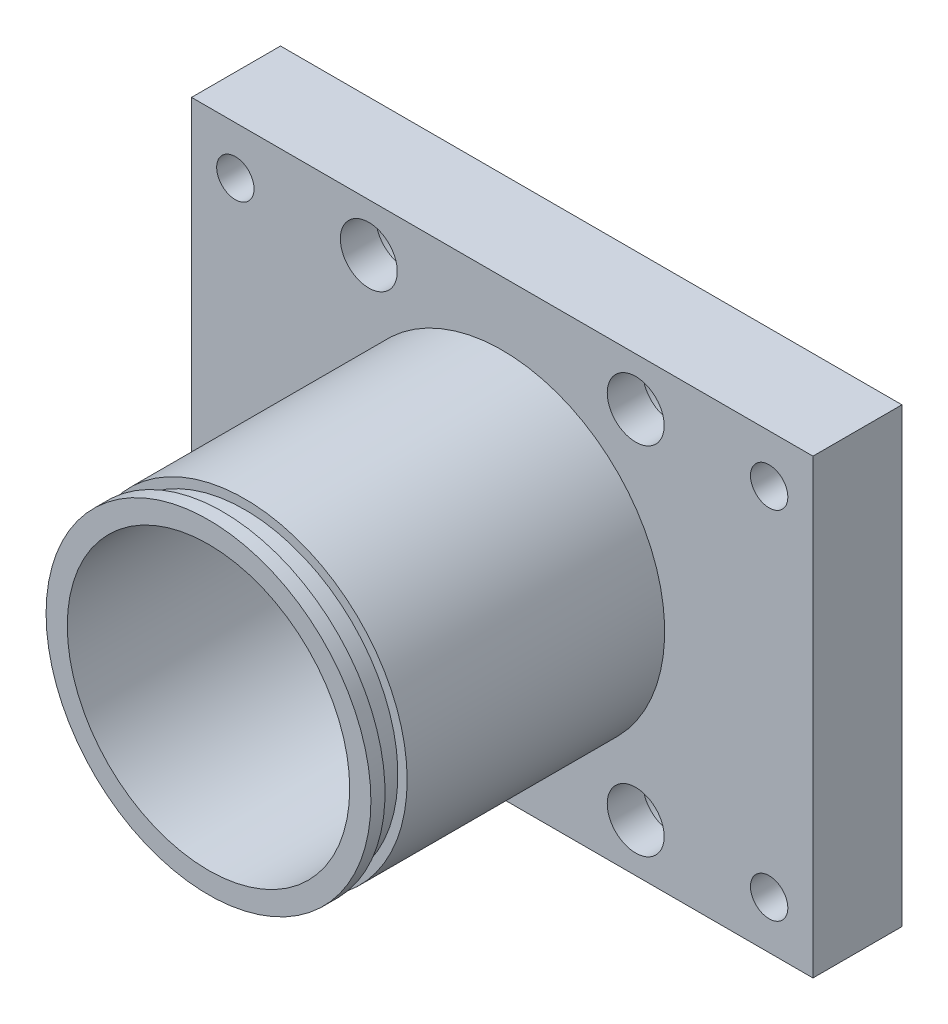
ISO-10303-21;
HEADER;
FILE_DESCRIPTION(('STEP AP214'),'2;1');
FILE_NAME('part.step','',(''),(''),'','','');
FILE_SCHEMA(('AUTOMOTIVE_DESIGN { 1 0 10303 214 1 1 1 1 }'));
ENDSEC;
DATA;
#1=APPLICATION_CONTEXT('core data for automotive mechanical design processes');
#2=APPLICATION_PROTOCOL_DEFINITION('international standard','automotive_design',2000,#1);
#3=PRODUCT_CONTEXT('',#1,'mechanical');
#4=PRODUCT('Part','Part','',(#3));
#5=PRODUCT_RELATED_PRODUCT_CATEGORY('part','',(#4));
#6=PRODUCT_DEFINITION_FORMATION('','',#4);
#7=PRODUCT_DEFINITION_CONTEXT('part definition',#1,'design');
#8=PRODUCT_DEFINITION('design','',#6,#7);
#9=PRODUCT_DEFINITION_SHAPE('','',#8);
#10=(LENGTH_UNIT() NAMED_UNIT(*) SI_UNIT(.MILLI.,.METRE.));
#11=(NAMED_UNIT(*) PLANE_ANGLE_UNIT() SI_UNIT($,.RADIAN.));
#12=(NAMED_UNIT(*) SI_UNIT($,.STERADIAN.) SOLID_ANGLE_UNIT());
#13=UNCERTAINTY_MEASURE_WITH_UNIT(LENGTH_MEASURE(1.E-05),#10,'distance_accuracy_value','');
#14=(GEOMETRIC_REPRESENTATION_CONTEXT(3) GLOBAL_UNCERTAINTY_ASSIGNED_CONTEXT((#13)) GLOBAL_UNIT_ASSIGNED_CONTEXT((#10,
#11,#12)) REPRESENTATION_CONTEXT('',''));
#15=CARTESIAN_POINT('',(0.,0.,0.));
#16=DIRECTION('',(0.,0.,1.));
#17=DIRECTION('',(1.,0.,0.));
#18=AXIS2_PLACEMENT_3D('',#15,#16,#17);
#19=CARTESIAN_POINT('',(0.,0.,43.02));
#20=DIRECTION('',(0.,0.,-1.));
#21=DIRECTION('',(-1.,0.,0.));
#22=AXIS2_PLACEMENT_3D('',#19,#20,#21);
#23=CYLINDRICAL_SURFACE('',#22,18.25625);
#24=CARTESIAN_POINT('',(0.,0.,43.02));
#25=DIRECTION('',(0.,0.,1.));
#26=DIRECTION('',(1.,0.,0.));
#27=AXIS2_PLACEMENT_3D('',#24,#25,#26);
#28=CIRCLE('',#27,18.25625);
#29=CARTESIAN_POINT('',(18.25625,0.,43.02));
#30=VERTEX_POINT('',#29);
#31=EDGE_CURVE('E140',#30,#30,#28,.T.);
#32=ORIENTED_EDGE('',*,*,#31,.F.);
#33=EDGE_LOOP('',(#32));
#34=FACE_BOUND('',#33,.T.);
#35=CARTESIAN_POINT('',(0.,0.,41.4325));
#36=DIRECTION('',(0.,0.,-1.));
#37=DIRECTION('',(-1.,0.,0.));
#38=AXIS2_PLACEMENT_3D('',#35,#36,#37);
#39=CIRCLE('',#38,18.25625);
#40=CARTESIAN_POINT('',(-18.25625,0.,41.4325));
#41=VERTEX_POINT('',#40);
#42=EDGE_CURVE('E36',#41,#41,#39,.T.);
#43=ORIENTED_EDGE('',*,*,#42,.F.);
#44=EDGE_LOOP('',(#43));
#45=FACE_BOUND('',#44,.T.);
#46=ADVANCED_FACE('F32',(#34,#45),#23,.T.);
#47=CARTESIAN_POINT('',(0.,0.,10.));
#48=DIRECTION('',(0.,0.,-1.));
#49=DIRECTION('',(-1.,0.,0.));
#50=AXIS2_PLACEMENT_3D('',#47,#48,#49);
#51=CIRCLE('',#50,18.25625);
#52=CARTESIAN_POINT('',(-18.25625,0.,10.));
#53=VERTEX_POINT('',#52);
#54=EDGE_CURVE('E11',#53,#53,#51,.F.);
#55=ORIENTED_EDGE('',*,*,#54,.T.);
#56=EDGE_LOOP('',(#55));
#57=FACE_BOUND('',#56,.T.);
#58=CARTESIAN_POINT('',(0.,0.,38.9433));
#59=DIRECTION('',(0.,0.,1.));
#60=DIRECTION('',(1.,0.,0.));
#61=AXIS2_PLACEMENT_3D('',#58,#59,#60);
#62=CIRCLE('',#61,18.25625);
#63=CARTESIAN_POINT('',(18.25625,0.,38.9433));
#64=VERTEX_POINT('',#63);
#65=EDGE_CURVE('E111',#64,#64,#62,.T.);
#66=ORIENTED_EDGE('',*,*,#65,.F.);
#67=EDGE_LOOP('',(#66));
#68=FACE_BOUND('',#67,.T.);
#69=ADVANCED_FACE('F247',(#57,#68),#23,.T.);
#70=CARTESIAN_POINT('',(34.925,25.4,0.));
#71=DIRECTION('',(0.,0.,-1.));
#72=DIRECTION('',(-1.,0.,0.));
#73=AXIS2_PLACEMENT_3D('',#70,#71,#72);
#74=PLANE('',#73);
#75=CARTESIAN_POINT('',(0.,0.,0.));
#76=DIRECTION('',(0.,0.,1.));
#77=DIRECTION('',(1.,0.,0.));
#78=AXIS2_PLACEMENT_3D('',#75,#76,#77);
#79=CIRCLE('',#78,15.875);
#80=CARTESIAN_POINT('',(15.875,0.,0.));
#81=VERTEX_POINT('',#80);
#82=EDGE_CURVE('E105',#81,#81,#79,.T.);
#83=ORIENTED_EDGE('',*,*,#82,.T.);
#84=EDGE_LOOP('',(#83));
#85=FACE_BOUND('',#84,.T.);
#86=CARTESIAN_POINT('',(0.,0.,0.));
#87=DIRECTION('',(0.,0.,-1.));
#88=DIRECTION('',(-1.,0.,0.));
#89=AXIS2_PLACEMENT_3D('',#86,#87,#88);
#90=CIRCLE('',#89,16.66875);
#91=CARTESIAN_POINT('',(-16.66875,0.,0.));
#92=VERTEX_POINT('',#91);
#93=EDGE_CURVE('E117',#92,#92,#90,.T.);
#94=ORIENTED_EDGE('',*,*,#93,.T.);
#95=EDGE_LOOP('',(#94));
#96=FACE_BOUND('',#95,.T.);
#97=ADVANCED_FACE('F218',(#85,#96),#74,.T.);
#98=CARTESIAN_POINT('',(34.925,25.4,10.));
#99=DIRECTION('',(0.,0.,-1.));
#100=DIRECTION('',(-1.,0.,0.));
#101=AXIS2_PLACEMENT_3D('',#98,#99,#100);
#102=PLANE('',#101);
#103=DIRECTION('',(0.,1.,0.));
#104=VECTOR('',#103,1.);
#105=CARTESIAN_POINT('',(34.925,-25.4,10.));
#106=LINE('',#105,#104);
#107=CARTESIAN_POINT('',(34.925,-25.4,10.));
#108=VERTEX_POINT('',#107);
#109=CARTESIAN_POINT('',(34.925,25.4,10.));
#110=VERTEX_POINT('',#109);
#111=EDGE_CURVE('E88',#108,#110,#106,.T.);
#112=ORIENTED_EDGE('',*,*,#111,.T.);
#113=DIRECTION('',(-1.,0.,0.));
#114=VECTOR('',#113,1.);
#115=CARTESIAN_POINT('',(-34.925,25.4,10.));
#116=LINE('',#115,#114);
#117=CARTESIAN_POINT('',(-34.925,25.4,10.));
#118=VERTEX_POINT('',#117);
#119=EDGE_CURVE('E82',#110,#118,#116,.T.);
#120=ORIENTED_EDGE('',*,*,#119,.T.);
#121=DIRECTION('',(0.,-1.,0.));
#122=VECTOR('',#121,1.);
#123=CARTESIAN_POINT('',(-34.925,-25.4,10.));
#124=LINE('',#123,#122);
#125=CARTESIAN_POINT('',(-34.925,-25.4,10.));
#126=VERTEX_POINT('',#125);
#127=EDGE_CURVE('E86',#118,#126,#124,.T.);
#128=ORIENTED_EDGE('',*,*,#127,.T.);
#129=DIRECTION('',(1.,0.,0.));
#130=VECTOR('',#129,1.);
#131=CARTESIAN_POINT('',(-34.925,-25.4,10.));
#132=LINE('',#131,#130);
#133=EDGE_CURVE('E51',#126,#108,#132,.T.);
#134=ORIENTED_EDGE('',*,*,#133,.T.);
#135=EDGE_LOOP('',(#112,#120,#128,#134));
#136=FACE_BOUND('',#135,.T.);
#137=CARTESIAN_POINT('',(30.,19.999999878,10.));
#138=DIRECTION('',(0.,0.,1.));
#139=DIRECTION('',(1.,0.,0.));
#140=AXIS2_PLACEMENT_3D('',#137,#138,#139);
#141=CIRCLE('',#140,2.09999999999999);
#142=CARTESIAN_POINT('',(32.1,19.999999878,10.));
#143=VERTEX_POINT('',#142);
#144=EDGE_CURVE('E209',#143,#143,#141,.T.);
#145=ORIENTED_EDGE('',*,*,#144,.F.);
#146=EDGE_LOOP('',(#145));
#147=FACE_BOUND('',#146,.T.);
#148=CARTESIAN_POINT('',(15.,20.,10.));
#149=DIRECTION('',(0.,0.,-1.));
#150=DIRECTION('',(-1.,0.,0.));
#151=AXIS2_PLACEMENT_3D('',#148,#149,#150);
#152=CIRCLE('',#151,3.2);
#153=CARTESIAN_POINT('',(11.8,20.,10.));
#154=VERTEX_POINT('',#153);
#155=EDGE_CURVE('E206',#154,#154,#152,.T.);
#156=ORIENTED_EDGE('',*,*,#155,.T.);
#157=EDGE_LOOP('',(#156));
#158=FACE_BOUND('',#157,.T.);
#159=CARTESIAN_POINT('',(30.,-19.999999878,10.));
#160=DIRECTION('',(0.,0.,1.));
#161=DIRECTION('',(1.,0.,0.));
#162=AXIS2_PLACEMENT_3D('',#159,#160,#161);
#163=CIRCLE('',#162,2.09999999999999);
#164=CARTESIAN_POINT('',(32.1,-19.999999878,10.));
#165=VERTEX_POINT('',#164);
#166=EDGE_CURVE('E191',#165,#165,#163,.T.);
#167=ORIENTED_EDGE('',*,*,#166,.F.);
#168=EDGE_LOOP('',(#167));
#169=FACE_BOUND('',#168,.T.);
#170=CARTESIAN_POINT('',(15.,-20.,10.));
#171=DIRECTION('',(0.,0.,-1.));
#172=DIRECTION('',(-1.,0.,0.));
#173=AXIS2_PLACEMENT_3D('',#170,#171,#172);
#174=CIRCLE('',#173,3.2);
#175=CARTESIAN_POINT('',(11.8,-20.,10.));
#176=VERTEX_POINT('',#175);
#177=EDGE_CURVE('E188',#176,#176,#174,.T.);
#178=ORIENTED_EDGE('',*,*,#177,.T.);
#179=EDGE_LOOP('',(#178));
#180=FACE_BOUND('',#179,.T.);
#181=CARTESIAN_POINT('',(-30.,-19.999999878,10.));
#182=DIRECTION('',(0.,0.,1.));
#183=DIRECTION('',(1.,0.,0.));
#184=AXIS2_PLACEMENT_3D('',#181,#182,#183);
#185=CIRCLE('',#184,2.09999999999999);
#186=CARTESIAN_POINT('',(-27.9,-19.999999878,10.));
#187=VERTEX_POINT('',#186);
#188=EDGE_CURVE('E173',#187,#187,#185,.T.);
#189=ORIENTED_EDGE('',*,*,#188,.F.);
#190=EDGE_LOOP('',(#189));
#191=FACE_BOUND('',#190,.T.);
#192=CARTESIAN_POINT('',(-15.,-20.,10.));
#193=DIRECTION('',(0.,0.,-1.));
#194=DIRECTION('',(-1.,0.,0.));
#195=AXIS2_PLACEMENT_3D('',#192,#193,#194);
#196=CIRCLE('',#195,3.2);
#197=CARTESIAN_POINT('',(-18.2,-20.,10.));
#198=VERTEX_POINT('',#197);
#199=EDGE_CURVE('E170',#198,#198,#196,.T.);
#200=ORIENTED_EDGE('',*,*,#199,.T.);
#201=EDGE_LOOP('',(#200));
#202=FACE_BOUND('',#201,.T.);
#203=CARTESIAN_POINT('',(-30.,19.999999878,10.));
#204=DIRECTION('',(0.,0.,1.));
#205=DIRECTION('',(1.,0.,0.));
#206=AXIS2_PLACEMENT_3D('',#203,#204,#205);
#207=CIRCLE('',#206,2.09999999999999);
#208=CARTESIAN_POINT('',(-27.9,19.999999878,10.));
#209=VERTEX_POINT('',#208);
#210=EDGE_CURVE('E155',#209,#209,#207,.T.);
#211=ORIENTED_EDGE('',*,*,#210,.F.);
#212=EDGE_LOOP('',(#211));
#213=FACE_BOUND('',#212,.T.);
#214=CARTESIAN_POINT('',(-15.,20.,10.));
#215=DIRECTION('',(0.,0.,-1.));
#216=DIRECTION('',(-1.,0.,0.));
#217=AXIS2_PLACEMENT_3D('',#214,#215,#216);
#218=CIRCLE('',#217,3.2);
#219=CARTESIAN_POINT('',(-18.2,20.,10.));
#220=VERTEX_POINT('',#219);
#221=EDGE_CURVE('E152',#220,#220,#218,.T.);
#222=ORIENTED_EDGE('',*,*,#221,.T.);
#223=EDGE_LOOP('',(#222));
#224=FACE_BOUND('',#223,.T.);
#225=ORIENTED_EDGE('',*,*,#54,.F.);
#226=EDGE_LOOP('',(#225));
#227=FACE_BOUND('',#226,.T.);
#228=ADVANCED_FACE('F83',(#136,#147,#158,#169,#180,#191,#202,#213,#224,#227),#102,.F.);
#229=CARTESIAN_POINT('',(0.,0.,0.));
#230=DIRECTION('',(0.,0.,-1.));
#231=DIRECTION('',(-1.,0.,0.));
#232=AXIS2_PLACEMENT_3D('',#229,#230,#231);
#233=CIRCLE('',#232,18.85315);
#234=CARTESIAN_POINT('',(-18.85315,0.,0.));
#235=VERTEX_POINT('',#234);
#236=EDGE_CURVE('E129',#235,#235,#233,.T.);
#237=ORIENTED_EDGE('',*,*,#236,.F.);
#238=EDGE_LOOP('',(#237));
#239=FACE_BOUND('',#238,.T.);
#240=CARTESIAN_POINT('',(-15.,20.,0.));
#241=DIRECTION('',(0.,0.,-1.));
#242=DIRECTION('',(-1.,0.,0.));
#243=AXIS2_PLACEMENT_3D('',#240,#241,#242);
#244=CIRCLE('',#243,5.05);
#245=CARTESIAN_POINT('',(-20.05,20.,0.));
#246=VERTEX_POINT('',#245);
#247=EDGE_CURVE('E143',#246,#246,#244,.T.);
#248=ORIENTED_EDGE('',*,*,#247,.F.);
#249=EDGE_LOOP('',(#248));
#250=FACE_BOUND('',#249,.T.);
#251=DIRECTION('',(0.,1.,0.));
#252=VECTOR('',#251,1.);
#253=CARTESIAN_POINT('',(34.925,-25.4,0.));
#254=LINE('',#253,#252);
#255=CARTESIAN_POINT('',(34.925,-25.4,0.));
#256=VERTEX_POINT('',#255);
#257=CARTESIAN_POINT('',(34.925,25.4,0.));
#258=VERTEX_POINT('',#257);
#259=EDGE_CURVE('E102',#256,#258,#254,.T.);
#260=ORIENTED_EDGE('',*,*,#259,.F.);
#261=DIRECTION('',(1.,0.,0.));
#262=VECTOR('',#261,1.);
#263=CARTESIAN_POINT('',(-34.925,-25.4,0.));
#264=LINE('',#263,#262);
#265=CARTESIAN_POINT('',(-34.925,-25.4,0.));
#266=VERTEX_POINT('',#265);
#267=EDGE_CURVE('E74',#266,#256,#264,.T.);
#268=ORIENTED_EDGE('',*,*,#267,.F.);
#269=DIRECTION('',(0.,-1.,0.));
#270=VECTOR('',#269,1.);
#271=CARTESIAN_POINT('',(-34.925,-25.4,0.));
#272=LINE('',#271,#270);
#273=CARTESIAN_POINT('',(-34.925,25.4,0.));
#274=VERTEX_POINT('',#273);
#275=EDGE_CURVE('E68',#274,#266,#272,.T.);
#276=ORIENTED_EDGE('',*,*,#275,.F.);
#277=DIRECTION('',(-1.,0.,0.));
#278=VECTOR('',#277,1.);
#279=CARTESIAN_POINT('',(-34.925,25.4,0.));
#280=LINE('',#279,#278);
#281=EDGE_CURVE('E93',#258,#274,#280,.T.);
#282=ORIENTED_EDGE('',*,*,#281,.F.);
#283=EDGE_LOOP('',(#260,#268,#276,#282));
#284=FACE_BOUND('',#283,.T.);
#285=CARTESIAN_POINT('',(30.,19.999999878,0.));
#286=DIRECTION('',(0.,0.,1.));
#287=DIRECTION('',(1.,0.,0.));
#288=AXIS2_PLACEMENT_3D('',#285,#286,#287);
#289=CIRCLE('',#288,2.1);
#290=CARTESIAN_POINT('',(32.1,19.999999878,0.));
#291=VERTEX_POINT('',#290);
#292=EDGE_CURVE('E212',#291,#291,#289,.T.);
#293=ORIENTED_EDGE('',*,*,#292,.T.);
#294=EDGE_LOOP('',(#293));
#295=FACE_BOUND('',#294,.T.);
#296=CARTESIAN_POINT('',(15.,20.,0.));
#297=DIRECTION('',(0.,0.,-1.));
#298=DIRECTION('',(-1.,0.,0.));
#299=AXIS2_PLACEMENT_3D('',#296,#297,#298);
#300=CIRCLE('',#299,5.05);
#301=CARTESIAN_POINT('',(9.95,20.,0.));
#302=VERTEX_POINT('',#301);
#303=EDGE_CURVE('E197',#302,#302,#300,.T.);
#304=ORIENTED_EDGE('',*,*,#303,.F.);
#305=EDGE_LOOP('',(#304));
#306=FACE_BOUND('',#305,.T.);
#307=CARTESIAN_POINT('',(30.,-19.999999878,0.));
#308=DIRECTION('',(0.,0.,1.));
#309=DIRECTION('',(1.,0.,0.));
#310=AXIS2_PLACEMENT_3D('',#307,#308,#309);
#311=CIRCLE('',#310,2.1);
#312=CARTESIAN_POINT('',(32.1,-19.999999878,0.));
#313=VERTEX_POINT('',#312);
#314=EDGE_CURVE('E194',#313,#313,#311,.T.);
#315=ORIENTED_EDGE('',*,*,#314,.T.);
#316=EDGE_LOOP('',(#315));
#317=FACE_BOUND('',#316,.T.);
#318=CARTESIAN_POINT('',(15.,-20.,0.));
#319=DIRECTION('',(0.,0.,-1.));
#320=DIRECTION('',(-1.,0.,0.));
#321=AXIS2_PLACEMENT_3D('',#318,#319,#320);
#322=CIRCLE('',#321,5.05);
#323=CARTESIAN_POINT('',(9.95,-20.,0.));
#324=VERTEX_POINT('',#323);
#325=EDGE_CURVE('E179',#324,#324,#322,.T.);
#326=ORIENTED_EDGE('',*,*,#325,.F.);
#327=EDGE_LOOP('',(#326));
#328=FACE_BOUND('',#327,.T.);
#329=CARTESIAN_POINT('',(-30.,-19.999999878,0.));
#330=DIRECTION('',(0.,0.,1.));
#331=DIRECTION('',(1.,0.,0.));
#332=AXIS2_PLACEMENT_3D('',#329,#330,#331);
#333=CIRCLE('',#332,2.1);
#334=CARTESIAN_POINT('',(-27.9,-19.999999878,0.));
#335=VERTEX_POINT('',#334);
#336=EDGE_CURVE('E176',#335,#335,#333,.T.);
#337=ORIENTED_EDGE('',*,*,#336,.T.);
#338=EDGE_LOOP('',(#337));
#339=FACE_BOUND('',#338,.T.);
#340=CARTESIAN_POINT('',(-15.,-20.,0.));
#341=DIRECTION('',(0.,0.,-1.));
#342=DIRECTION('',(-1.,0.,0.));
#343=AXIS2_PLACEMENT_3D('',#340,#341,#342);
#344=CIRCLE('',#343,5.05);
#345=CARTESIAN_POINT('',(-20.05,-20.,0.));
#346=VERTEX_POINT('',#345);
#347=EDGE_CURVE('E161',#346,#346,#344,.T.);
#348=ORIENTED_EDGE('',*,*,#347,.F.);
#349=EDGE_LOOP('',(#348));
#350=FACE_BOUND('',#349,.T.);
#351=CARTESIAN_POINT('',(-30.,19.999999878,0.));
#352=DIRECTION('',(0.,0.,1.));
#353=DIRECTION('',(1.,0.,0.));
#354=AXIS2_PLACEMENT_3D('',#351,#352,#353);
#355=CIRCLE('',#354,2.1);
#356=CARTESIAN_POINT('',(-27.9,19.999999878,0.));
#357=VERTEX_POINT('',#356);
#358=EDGE_CURVE('E158',#357,#357,#355,.T.);
#359=ORIENTED_EDGE('',*,*,#358,.T.);
#360=EDGE_LOOP('',(#359));
#361=FACE_BOUND('',#360,.T.);
#362=ADVANCED_FACE('F316',(#239,#250,#284,#295,#306,#317,#328,#339,#350,#361),#74,.T.);
#363=CARTESIAN_POINT('',(34.925,-25.4,10.));
#364=DIRECTION('',(-1.,0.,0.));
#365=DIRECTION('',(0.,0.,1.));
#366=AXIS2_PLACEMENT_3D('',#363,#364,#365);
#367=PLANE('',#366);
#368=ORIENTED_EDGE('',*,*,#259,.T.);
#369=DIRECTION('',(0.,0.,-1.));
#370=VECTOR('',#369,1.);
#371=CARTESIAN_POINT('',(34.925,25.4,10.));
#372=LINE('',#371,#370);
#373=EDGE_CURVE('E42',#110,#258,#372,.T.);
#374=ORIENTED_EDGE('',*,*,#373,.F.);
#375=ORIENTED_EDGE('',*,*,#111,.F.);
#376=DIRECTION('',(0.,0.,-1.));
#377=VECTOR('',#376,1.);
#378=CARTESIAN_POINT('',(34.925,-25.4,10.));
#379=LINE('',#378,#377);
#380=EDGE_CURVE('E98',#108,#256,#379,.T.);
#381=ORIENTED_EDGE('',*,*,#380,.T.);
#382=EDGE_LOOP('',(#368,#374,#375,#381));
#383=FACE_BOUND('',#382,.T.);
#384=ADVANCED_FACE('F34',(#383),#367,.F.);
#385=CARTESIAN_POINT('',(-34.925,25.4,10.));
#386=DIRECTION('',(0.,-1.,0.));
#387=DIRECTION('',(0.,0.,-1.));
#388=AXIS2_PLACEMENT_3D('',#385,#386,#387);
#389=PLANE('',#388);
#390=ORIENTED_EDGE('',*,*,#281,.T.);
#391=DIRECTION('',(0.,0.,-1.));
#392=VECTOR('',#391,1.);
#393=CARTESIAN_POINT('',(-34.925,25.4,10.));
#394=LINE('',#393,#392);
#395=EDGE_CURVE('E91',#118,#274,#394,.T.);
#396=ORIENTED_EDGE('',*,*,#395,.F.);
#397=ORIENTED_EDGE('',*,*,#119,.F.);
#398=ORIENTED_EDGE('',*,*,#373,.T.);
#399=EDGE_LOOP('',(#390,#396,#397,#398));
#400=FACE_BOUND('',#399,.T.);
#401=ADVANCED_FACE('F92',(#400),#389,.F.);
#402=CARTESIAN_POINT('',(-34.925,-25.4,10.));
#403=DIRECTION('',(1.,0.,0.));
#404=DIRECTION('',(0.,0.,-1.));
#405=AXIS2_PLACEMENT_3D('',#402,#403,#404);
#406=PLANE('',#405);
#407=ORIENTED_EDGE('',*,*,#275,.T.);
#408=DIRECTION('',(0.,0.,-1.));
#409=VECTOR('',#408,1.);
#410=CARTESIAN_POINT('',(-34.925,-25.4,10.));
#411=LINE('',#410,#409);
#412=EDGE_CURVE('E94',#126,#266,#411,.T.);
#413=ORIENTED_EDGE('',*,*,#412,.F.);
#414=ORIENTED_EDGE('',*,*,#127,.F.);
#415=ORIENTED_EDGE('',*,*,#395,.T.);
#416=EDGE_LOOP('',(#407,#413,#414,#415));
#417=FACE_BOUND('',#416,.T.);
#418=ADVANCED_FACE('F96',(#417),#406,.F.);
#419=CARTESIAN_POINT('',(-34.925,-25.4,10.));
#420=DIRECTION('',(0.,1.,0.));
#421=DIRECTION('',(0.,0.,1.));
#422=AXIS2_PLACEMENT_3D('',#419,#420,#421);
#423=PLANE('',#422);
#424=ORIENTED_EDGE('',*,*,#267,.T.);
#425=ORIENTED_EDGE('',*,*,#380,.F.);
#426=ORIENTED_EDGE('',*,*,#133,.F.);
#427=ORIENTED_EDGE('',*,*,#412,.T.);
#428=EDGE_LOOP('',(#424,#425,#426,#427));
#429=FACE_BOUND('',#428,.T.);
#430=ADVANCED_FACE('F225',(#429),#423,.F.);
#431=CARTESIAN_POINT('',(0.,0.,0.));
#432=DIRECTION('',(0.,0.,1.));
#433=DIRECTION('',(1.,0.,0.));
#434=AXIS2_PLACEMENT_3D('',#431,#432,#433);
#435=CYLINDRICAL_SURFACE('',#434,15.875);
#436=ORIENTED_EDGE('',*,*,#82,.F.);
#437=EDGE_LOOP('',(#436));
#438=FACE_BOUND('',#437,.T.);
#439=CARTESIAN_POINT('',(0.,0.,43.02));
#440=DIRECTION('',(0.,0.,1.));
#441=DIRECTION('',(1.,0.,0.));
#442=AXIS2_PLACEMENT_3D('',#439,#440,#441);
#443=CIRCLE('',#442,15.875);
#444=CARTESIAN_POINT('',(15.875,0.,43.02));
#445=VERTEX_POINT('',#444);
#446=EDGE_CURVE('E135',#445,#445,#443,.T.);
#447=ORIENTED_EDGE('',*,*,#446,.T.);
#448=EDGE_LOOP('',(#447));
#449=FACE_BOUND('',#448,.T.);
#450=ADVANCED_FACE('F221',(#438,#449),#435,.F.);
#451=CARTESIAN_POINT('',(30.,19.999999878,10.));
#452=DIRECTION('',(0.,0.,1.));
#453=DIRECTION('',(1.,0.,0.));
#454=AXIS2_PLACEMENT_3D('',#451,#452,#453);
#455=CYLINDRICAL_SURFACE('',#454,2.09999999999999);
#456=ORIENTED_EDGE('',*,*,#292,.F.);
#457=EDGE_LOOP('',(#456));
#458=FACE_BOUND('',#457,.T.);
#459=ORIENTED_EDGE('',*,*,#144,.T.);
#460=EDGE_LOOP('',(#459));
#461=FACE_BOUND('',#460,.T.);
#462=ADVANCED_FACE('F224',(#458,#461),#455,.F.);
#463=CARTESIAN_POINT('',(15.,20.,0.));
#464=DIRECTION('',(0.,0.,-1.));
#465=DIRECTION('',(-1.,0.,0.));
#466=AXIS2_PLACEMENT_3D('',#463,#464,#465);
#467=CYLINDRICAL_SURFACE('',#466,3.2);
#468=ORIENTED_EDGE('',*,*,#155,.F.);
#469=EDGE_LOOP('',(#468));
#470=FACE_BOUND('',#469,.T.);
#471=CARTESIAN_POINT('',(15.,20.,6.));
#472=DIRECTION('',(0.,0.,-1.));
#473=DIRECTION('',(-1.,0.,0.));
#474=AXIS2_PLACEMENT_3D('',#471,#472,#473);
#475=CIRCLE('',#474,3.2);
#476=CARTESIAN_POINT('',(11.8,20.,6.));
#477=VERTEX_POINT('',#476);
#478=EDGE_CURVE('E203',#477,#477,#475,.T.);
#479=ORIENTED_EDGE('',*,*,#478,.T.);
#480=EDGE_LOOP('',(#479));
#481=FACE_BOUND('',#480,.T.);
#482=ADVANCED_FACE('F306',(#470,#481),#467,.F.);
#483=CARTESIAN_POINT('',(18.2,20.,6.));
#484=DIRECTION('',(0.,0.,1.));
#485=DIRECTION('',(1.,0.,0.));
#486=AXIS2_PLACEMENT_3D('',#483,#484,#485);
#487=PLANE('',#486);
#488=ORIENTED_EDGE('',*,*,#478,.F.);
#489=EDGE_LOOP('',(#488));
#490=FACE_BOUND('',#489,.T.);
#491=CARTESIAN_POINT('',(15.,20.,6.));
#492=DIRECTION('',(0.,0.,-1.));
#493=DIRECTION('',(-1.,0.,0.));
#494=AXIS2_PLACEMENT_3D('',#491,#492,#493);
#495=CIRCLE('',#494,5.05);
#496=CARTESIAN_POINT('',(9.95,20.,6.));
#497=VERTEX_POINT('',#496);
#498=EDGE_CURVE('E200',#497,#497,#495,.T.);
#499=ORIENTED_EDGE('',*,*,#498,.T.);
#500=EDGE_LOOP('',(#499));
#501=FACE_BOUND('',#500,.T.);
#502=ADVANCED_FACE('F302',(#490,#501),#487,.F.);
#503=CARTESIAN_POINT('',(15.,20.,0.));
#504=DIRECTION('',(0.,0.,-1.));
#505=DIRECTION('',(-1.,0.,0.));
#506=AXIS2_PLACEMENT_3D('',#503,#504,#505);
#507=CYLINDRICAL_SURFACE('',#506,5.05);
#508=ORIENTED_EDGE('',*,*,#498,.F.);
#509=EDGE_LOOP('',(#508));
#510=FACE_BOUND('',#509,.T.);
#511=ORIENTED_EDGE('',*,*,#303,.T.);
#512=EDGE_LOOP('',(#511));
#513=FACE_BOUND('',#512,.T.);
#514=ADVANCED_FACE('F298',(#510,#513),#507,.F.);
#515=CARTESIAN_POINT('',(30.,-19.999999878,10.));
#516=DIRECTION('',(0.,0.,1.));
#517=DIRECTION('',(1.,0.,0.));
#518=AXIS2_PLACEMENT_3D('',#515,#516,#517);
#519=CYLINDRICAL_SURFACE('',#518,2.09999999999999);
#520=ORIENTED_EDGE('',*,*,#314,.F.);
#521=EDGE_LOOP('',(#520));
#522=FACE_BOUND('',#521,.T.);
#523=ORIENTED_EDGE('',*,*,#166,.T.);
#524=EDGE_LOOP('',(#523));
#525=FACE_BOUND('',#524,.T.);
#526=ADVANCED_FACE('F294',(#522,#525),#519,.F.);
#527=CARTESIAN_POINT('',(15.,-20.,0.));
#528=DIRECTION('',(0.,0.,-1.));
#529=DIRECTION('',(-1.,0.,0.));
#530=AXIS2_PLACEMENT_3D('',#527,#528,#529);
#531=CYLINDRICAL_SURFACE('',#530,3.2);
#532=ORIENTED_EDGE('',*,*,#177,.F.);
#533=EDGE_LOOP('',(#532));
#534=FACE_BOUND('',#533,.T.);
#535=CARTESIAN_POINT('',(15.,-20.,6.));
#536=DIRECTION('',(0.,0.,-1.));
#537=DIRECTION('',(-1.,0.,0.));
#538=AXIS2_PLACEMENT_3D('',#535,#536,#537);
#539=CIRCLE('',#538,3.2);
#540=CARTESIAN_POINT('',(11.8,-20.,6.));
#541=VERTEX_POINT('',#540);
#542=EDGE_CURVE('E185',#541,#541,#539,.T.);
#543=ORIENTED_EDGE('',*,*,#542,.T.);
#544=EDGE_LOOP('',(#543));
#545=FACE_BOUND('',#544,.T.);
#546=ADVANCED_FACE('F290',(#534,#545),#531,.F.);
#547=CARTESIAN_POINT('',(18.2,-20.,6.));
#548=DIRECTION('',(0.,0.,1.));
#549=DIRECTION('',(1.,0.,0.));
#550=AXIS2_PLACEMENT_3D('',#547,#548,#549);
#551=PLANE('',#550);
#552=ORIENTED_EDGE('',*,*,#542,.F.);
#553=EDGE_LOOP('',(#552));
#554=FACE_BOUND('',#553,.T.);
#555=CARTESIAN_POINT('',(15.,-20.,6.));
#556=DIRECTION('',(0.,0.,-1.));
#557=DIRECTION('',(-1.,0.,0.));
#558=AXIS2_PLACEMENT_3D('',#555,#556,#557);
#559=CIRCLE('',#558,5.05);
#560=CARTESIAN_POINT('',(9.95,-20.,6.));
#561=VERTEX_POINT('',#560);
#562=EDGE_CURVE('E182',#561,#561,#559,.T.);
#563=ORIENTED_EDGE('',*,*,#562,.T.);
#564=EDGE_LOOP('',(#563));
#565=FACE_BOUND('',#564,.T.);
#566=ADVANCED_FACE('F286',(#554,#565),#551,.F.);
#567=CARTESIAN_POINT('',(15.,-20.,0.));
#568=DIRECTION('',(0.,0.,-1.));
#569=DIRECTION('',(-1.,0.,0.));
#570=AXIS2_PLACEMENT_3D('',#567,#568,#569);
#571=CYLINDRICAL_SURFACE('',#570,5.05);
#572=ORIENTED_EDGE('',*,*,#562,.F.);
#573=EDGE_LOOP('',(#572));
#574=FACE_BOUND('',#573,.T.);
#575=ORIENTED_EDGE('',*,*,#325,.T.);
#576=EDGE_LOOP('',(#575));
#577=FACE_BOUND('',#576,.T.);
#578=ADVANCED_FACE('F282',(#574,#577),#571,.F.);
#579=CARTESIAN_POINT('',(-30.,-19.999999878,10.));
#580=DIRECTION('',(0.,0.,1.));
#581=DIRECTION('',(1.,0.,0.));
#582=AXIS2_PLACEMENT_3D('',#579,#580,#581);
#583=CYLINDRICAL_SURFACE('',#582,2.09999999999999);
#584=ORIENTED_EDGE('',*,*,#336,.F.);
#585=EDGE_LOOP('',(#584));
#586=FACE_BOUND('',#585,.T.);
#587=ORIENTED_EDGE('',*,*,#188,.T.);
#588=EDGE_LOOP('',(#587));
#589=FACE_BOUND('',#588,.T.);
#590=ADVANCED_FACE('F278',(#586,#589),#583,.F.);
#591=CARTESIAN_POINT('',(-15.,-20.,0.));
#592=DIRECTION('',(0.,0.,-1.));
#593=DIRECTION('',(-1.,0.,0.));
#594=AXIS2_PLACEMENT_3D('',#591,#592,#593);
#595=CYLINDRICAL_SURFACE('',#594,3.2);
#596=ORIENTED_EDGE('',*,*,#199,.F.);
#597=EDGE_LOOP('',(#596));
#598=FACE_BOUND('',#597,.T.);
#599=CARTESIAN_POINT('',(-15.,-20.,6.));
#600=DIRECTION('',(0.,0.,-1.));
#601=DIRECTION('',(-1.,0.,0.));
#602=AXIS2_PLACEMENT_3D('',#599,#600,#601);
#603=CIRCLE('',#602,3.2);
#604=CARTESIAN_POINT('',(-18.2,-20.,6.));
#605=VERTEX_POINT('',#604);
#606=EDGE_CURVE('E167',#605,#605,#603,.T.);
#607=ORIENTED_EDGE('',*,*,#606,.T.);
#608=EDGE_LOOP('',(#607));
#609=FACE_BOUND('',#608,.T.);
#610=ADVANCED_FACE('F274',(#598,#609),#595,.F.);
#611=CARTESIAN_POINT('',(-11.8,-20.,6.));
#612=DIRECTION('',(0.,0.,1.));
#613=DIRECTION('',(1.,0.,0.));
#614=AXIS2_PLACEMENT_3D('',#611,#612,#613);
#615=PLANE('',#614);
#616=ORIENTED_EDGE('',*,*,#606,.F.);
#617=EDGE_LOOP('',(#616));
#618=FACE_BOUND('',#617,.T.);
#619=CARTESIAN_POINT('',(-15.,-20.,6.));
#620=DIRECTION('',(0.,0.,-1.));
#621=DIRECTION('',(-1.,0.,0.));
#622=AXIS2_PLACEMENT_3D('',#619,#620,#621);
#623=CIRCLE('',#622,5.05);
#624=CARTESIAN_POINT('',(-20.05,-20.,6.));
#625=VERTEX_POINT('',#624);
#626=EDGE_CURVE('E164',#625,#625,#623,.T.);
#627=ORIENTED_EDGE('',*,*,#626,.T.);
#628=EDGE_LOOP('',(#627));
#629=FACE_BOUND('',#628,.T.);
#630=ADVANCED_FACE('F270',(#618,#629),#615,.F.);
#631=CARTESIAN_POINT('',(-15.,-20.,0.));
#632=DIRECTION('',(0.,0.,-1.));
#633=DIRECTION('',(-1.,0.,0.));
#634=AXIS2_PLACEMENT_3D('',#631,#632,#633);
#635=CYLINDRICAL_SURFACE('',#634,5.05);
#636=ORIENTED_EDGE('',*,*,#626,.F.);
#637=EDGE_LOOP('',(#636));
#638=FACE_BOUND('',#637,.T.);
#639=ORIENTED_EDGE('',*,*,#347,.T.);
#640=EDGE_LOOP('',(#639));
#641=FACE_BOUND('',#640,.T.);
#642=ADVANCED_FACE('F266',(#638,#641),#635,.F.);
#643=CARTESIAN_POINT('',(-30.,19.999999878,10.));
#644=DIRECTION('',(0.,0.,1.));
#645=DIRECTION('',(1.,0.,0.));
#646=AXIS2_PLACEMENT_3D('',#643,#644,#645);
#647=CYLINDRICAL_SURFACE('',#646,2.09999999999999);
#648=ORIENTED_EDGE('',*,*,#358,.F.);
#649=EDGE_LOOP('',(#648));
#650=FACE_BOUND('',#649,.T.);
#651=ORIENTED_EDGE('',*,*,#210,.T.);
#652=EDGE_LOOP('',(#651));
#653=FACE_BOUND('',#652,.T.);
#654=ADVANCED_FACE('F262',(#650,#653),#647,.F.);
#655=CARTESIAN_POINT('',(-15.,20.,0.));
#656=DIRECTION('',(0.,0.,-1.));
#657=DIRECTION('',(-1.,0.,0.));
#658=AXIS2_PLACEMENT_3D('',#655,#656,#657);
#659=CYLINDRICAL_SURFACE('',#658,3.2);
#660=ORIENTED_EDGE('',*,*,#221,.F.);
#661=EDGE_LOOP('',(#660));
#662=FACE_BOUND('',#661,.T.);
#663=CARTESIAN_POINT('',(-15.,20.,6.));
#664=DIRECTION('',(0.,0.,-1.));
#665=DIRECTION('',(-1.,0.,0.));
#666=AXIS2_PLACEMENT_3D('',#663,#664,#665);
#667=CIRCLE('',#666,3.2);
#668=CARTESIAN_POINT('',(-18.2,20.,6.));
#669=VERTEX_POINT('',#668);
#670=EDGE_CURVE('E149',#669,#669,#667,.T.);
#671=ORIENTED_EDGE('',*,*,#670,.T.);
#672=EDGE_LOOP('',(#671));
#673=FACE_BOUND('',#672,.T.);
#674=ADVANCED_FACE('F258',(#662,#673),#659,.F.);
#675=CARTESIAN_POINT('',(-11.8,20.,6.));
#676=DIRECTION('',(0.,0.,1.));
#677=DIRECTION('',(1.,0.,0.));
#678=AXIS2_PLACEMENT_3D('',#675,#676,#677);
#679=PLANE('',#678);
#680=ORIENTED_EDGE('',*,*,#670,.F.);
#681=EDGE_LOOP('',(#680));
#682=FACE_BOUND('',#681,.T.);
#683=CARTESIAN_POINT('',(-15.,20.,6.));
#684=DIRECTION('',(0.,0.,-1.));
#685=DIRECTION('',(-1.,0.,0.));
#686=AXIS2_PLACEMENT_3D('',#683,#684,#685);
#687=CIRCLE('',#686,5.05);
#688=CARTESIAN_POINT('',(-20.05,20.,6.));
#689=VERTEX_POINT('',#688);
#690=EDGE_CURVE('E146',#689,#689,#687,.T.);
#691=ORIENTED_EDGE('',*,*,#690,.T.);
#692=EDGE_LOOP('',(#691));
#693=FACE_BOUND('',#692,.T.);
#694=ADVANCED_FACE('F242',(#682,#693),#679,.F.);
#695=CARTESIAN_POINT('',(-15.,20.,0.));
#696=DIRECTION('',(0.,0.,-1.));
#697=DIRECTION('',(-1.,0.,0.));
#698=AXIS2_PLACEMENT_3D('',#695,#696,#697);
#699=CYLINDRICAL_SURFACE('',#698,5.05);
#700=ORIENTED_EDGE('',*,*,#690,.F.);
#701=EDGE_LOOP('',(#700));
#702=FACE_BOUND('',#701,.T.);
#703=ORIENTED_EDGE('',*,*,#247,.T.);
#704=EDGE_LOOP('',(#703));
#705=FACE_BOUND('',#704,.T.);
#706=ADVANCED_FACE('F232',(#702,#705),#699,.F.);
#707=CARTESIAN_POINT('',(0.,0.,43.02));
#708=DIRECTION('',(0.,0.,1.));
#709=DIRECTION('',(1.,0.,0.));
#710=AXIS2_PLACEMENT_3D('',#707,#708,#709);
#711=PLANE('',#710);
#712=ORIENTED_EDGE('',*,*,#31,.T.);
#713=EDGE_LOOP('',(#712));
#714=FACE_BOUND('',#713,.T.);
#715=ORIENTED_EDGE('',*,*,#446,.F.);
#716=EDGE_LOOP('',(#715));
#717=FACE_BOUND('',#716,.T.);
#718=ADVANCED_FACE('F229',(#714,#717),#711,.T.);
#719=CARTESIAN_POINT('',(0.,0.,1.3208));
#720=DIRECTION('',(0.,0.,-1.));
#721=DIRECTION('',(-1.,0.,0.));
#722=AXIS2_PLACEMENT_3D('',#719,#720,#721);
#723=CYLINDRICAL_SURFACE('',#722,18.85315);
#724=CARTESIAN_POINT('',(0.,0.,1.3208));
#725=DIRECTION('',(0.,0.,-1.));
#726=DIRECTION('',(-1.,0.,0.));
#727=AXIS2_PLACEMENT_3D('',#724,#725,#726);
#728=CIRCLE('',#727,18.85315);
#729=CARTESIAN_POINT('',(-18.85315,0.,1.3208));
#730=VERTEX_POINT('',#729);
#731=EDGE_CURVE('E132',#730,#730,#728,.T.);
#732=ORIENTED_EDGE('',*,*,#731,.F.);
#733=EDGE_LOOP('',(#732));
#734=FACE_BOUND('',#733,.T.);
#735=ORIENTED_EDGE('',*,*,#236,.T.);
#736=EDGE_LOOP('',(#735));
#737=FACE_BOUND('',#736,.T.);
#738=ADVANCED_FACE('F231',(#734,#737),#723,.F.);
#739=CARTESIAN_POINT('',(0.,0.,1.3208));
#740=DIRECTION('',(0.,0.,-1.));
#741=DIRECTION('',(-1.,0.,0.));
#742=AXIS2_PLACEMENT_3D('',#739,#740,#741);
#743=PLANE('',#742);
#744=CARTESIAN_POINT('',(0.,0.,1.3208));
#745=DIRECTION('',(0.,0.,-1.));
#746=DIRECTION('',(-1.,0.,0.));
#747=AXIS2_PLACEMENT_3D('',#744,#745,#746);
#748=CIRCLE('',#747,16.66875);
#749=CARTESIAN_POINT('',(-16.66875,0.,1.3208));
#750=VERTEX_POINT('',#749);
#751=EDGE_CURVE('E126',#750,#750,#748,.T.);
#752=ORIENTED_EDGE('',*,*,#751,.F.);
#753=EDGE_LOOP('',(#752));
#754=FACE_BOUND('',#753,.T.);
#755=ORIENTED_EDGE('',*,*,#731,.T.);
#756=EDGE_LOOP('',(#755));
#757=FACE_BOUND('',#756,.T.);
#758=ADVANCED_FACE('F239',(#754,#757),#743,.T.);
#759=CARTESIAN_POINT('',(0.,0.,1.3208));
#760=DIRECTION('',(0.,0.,-1.));
#761=DIRECTION('',(-1.,0.,0.));
#762=AXIS2_PLACEMENT_3D('',#759,#760,#761);
#763=CYLINDRICAL_SURFACE('',#762,16.66875);
#764=ORIENTED_EDGE('',*,*,#751,.T.);
#765=EDGE_LOOP('',(#764));
#766=FACE_BOUND('',#765,.T.);
#767=ORIENTED_EDGE('',*,*,#93,.F.);
#768=EDGE_LOOP('',(#767));
#769=FACE_BOUND('',#768,.T.);
#770=ADVANCED_FACE('F425',(#766,#769),#763,.T.);
#771=CARTESIAN_POINT('',(0.,-17.21104,41.4325));
#772=DIRECTION('',(0.,0.,-1.));
#773=DIRECTION('',(-1.,0.,0.));
#774=AXIS2_PLACEMENT_3D('',#771,#772,#773);
#775=PLANE('',#774);
#776=CARTESIAN_POINT('',(0.,0.,41.4325));
#777=DIRECTION('',(0.,0.,-1.));
#778=DIRECTION('',(-1.,0.,0.));
#779=AXIS2_PLACEMENT_3D('',#776,#777,#778);
#780=CIRCLE('',#779,17.21104);
#781=CARTESIAN_POINT('',(-17.21104,0.,41.4325));
#782=VERTEX_POINT('',#781);
#783=EDGE_CURVE('E113',#782,#782,#780,.T.);
#784=ORIENTED_EDGE('',*,*,#783,.F.);
#785=EDGE_LOOP('',(#784));
#786=FACE_BOUND('',#785,.T.);
#787=ORIENTED_EDGE('',*,*,#42,.T.);
#788=EDGE_LOOP('',(#787));
#789=FACE_BOUND('',#788,.T.);
#790=ADVANCED_FACE('F419',(#786,#789),#775,.T.);
#791=CARTESIAN_POINT('',(0.,-17.21104,38.9433));
#792=DIRECTION('',(0.,0.,1.));
#793=DIRECTION('',(1.,0.,0.));
#794=AXIS2_PLACEMENT_3D('',#791,#792,#793);
#795=PLANE('',#794);
#796=CARTESIAN_POINT('',(0.,0.,38.9433));
#797=DIRECTION('',(0.,0.,-1.));
#798=DIRECTION('',(-1.,0.,0.));
#799=AXIS2_PLACEMENT_3D('',#796,#797,#798);
#800=CIRCLE('',#799,17.21104);
#801=CARTESIAN_POINT('',(-17.21104,0.,38.9433));
#802=VERTEX_POINT('',#801);
#803=EDGE_CURVE('E119',#802,#802,#800,.T.);
#804=ORIENTED_EDGE('',*,*,#803,.T.);
#805=EDGE_LOOP('',(#804));
#806=FACE_BOUND('',#805,.T.);
#807=ORIENTED_EDGE('',*,*,#65,.T.);
#808=EDGE_LOOP('',(#807));
#809=FACE_BOUND('',#808,.T.);
#810=ADVANCED_FACE('F424',(#806,#809),#795,.T.);
#811=CARTESIAN_POINT('',(0.,0.,-4.39121143365093));
#812=DIRECTION('',(0.,0.,-1.));
#813=DIRECTION('',(-1.,0.,0.));
#814=AXIS2_PLACEMENT_3D('',#811,#812,#813);
#815=CYLINDRICAL_SURFACE('',#814,17.21104);
#816=ORIENTED_EDGE('',*,*,#783,.T.);
#817=EDGE_LOOP('',(#816));
#818=FACE_BOUND('',#817,.T.);
#819=ORIENTED_EDGE('',*,*,#803,.F.);
#820=EDGE_LOOP('',(#819));
#821=FACE_BOUND('',#820,.T.);
#822=ADVANCED_FACE('F436',(#818,#821),#815,.T.);
#823=CLOSED_SHELL('',(#46,#69,#97,#228,#362,#384,#401,#418,#430,#450,#462,#482,#502,#514,#526,
#546,#566,#578,#590,#610,#630,#642,#654,#674,#694,#706,#718,#738,#758,#770,#790,#810,#822));
#824=MANIFOLD_SOLID_BREP('B2',#823);
#825=ADVANCED_BREP_SHAPE_REPRESENTATION('',(#18,#824),#14);
#826=SHAPE_DEFINITION_REPRESENTATION(#9,#825);
ENDSEC;
END-ISO-10303-21;
